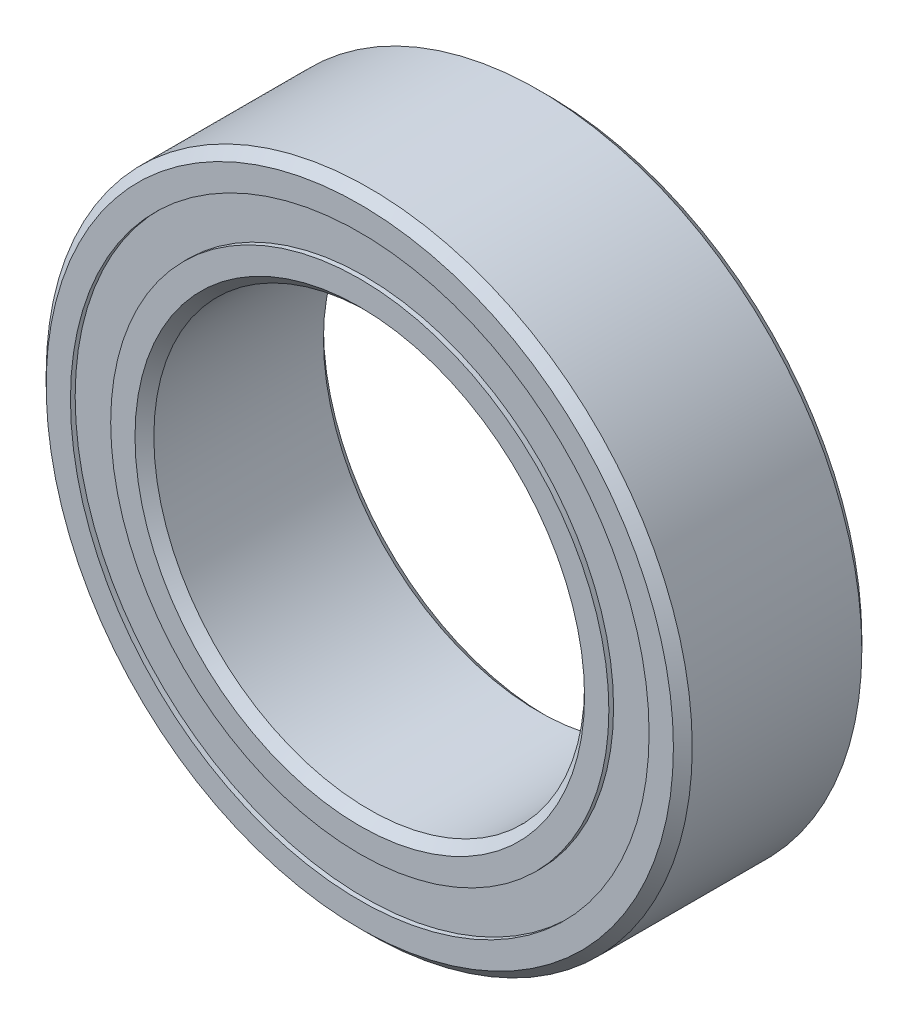
ISO-10303-21;
HEADER;
FILE_DESCRIPTION(('STEP AP214'),'2;1');
FILE_NAME('part.step','',(''),(''),'','','');
FILE_SCHEMA(('AUTOMOTIVE_DESIGN { 1 0 10303 214 1 1 1 1 }'));
ENDSEC;
DATA;
#1=APPLICATION_CONTEXT('core data for automotive mechanical design processes');
#2=APPLICATION_PROTOCOL_DEFINITION('international standard','automotive_design',2000,#1);
#3=PRODUCT_CONTEXT('',#1,'mechanical');
#4=PRODUCT('Part','Part','',(#3));
#5=PRODUCT_RELATED_PRODUCT_CATEGORY('part','',(#4));
#6=PRODUCT_DEFINITION_FORMATION('','',#4);
#7=PRODUCT_DEFINITION_CONTEXT('part definition',#1,'design');
#8=PRODUCT_DEFINITION('design','',#6,#7);
#9=PRODUCT_DEFINITION_SHAPE('','',#8);
#10=(LENGTH_UNIT() NAMED_UNIT(*) SI_UNIT(.MILLI.,.METRE.));
#11=(NAMED_UNIT(*) PLANE_ANGLE_UNIT() SI_UNIT($,.RADIAN.));
#12=(NAMED_UNIT(*) SI_UNIT($,.STERADIAN.) SOLID_ANGLE_UNIT());
#13=UNCERTAINTY_MEASURE_WITH_UNIT(LENGTH_MEASURE(1.E-05),#10,'distance_accuracy_value','');
#14=(GEOMETRIC_REPRESENTATION_CONTEXT(3) GLOBAL_UNCERTAINTY_ASSIGNED_CONTEXT((#13)) GLOBAL_UNIT_ASSIGNED_CONTEXT((#10,
#11,#12)) REPRESENTATION_CONTEXT('',''));
#15=CARTESIAN_POINT('',(0.,0.,0.));
#16=DIRECTION('',(0.,0.,1.));
#17=DIRECTION('',(1.,0.,0.));
#18=AXIS2_PLACEMENT_3D('',#15,#16,#17);
#19=CARTESIAN_POINT('',(0.,5.37362637362637,-1.6625));
#20=DIRECTION('',(0.,0.,1.));
#21=DIRECTION('',(1.,0.,0.));
#22=AXIS2_PLACEMENT_3D('',#19,#20,#21);
#23=PLANE('',#22);
#24=CARTESIAN_POINT('',(0.,0.,-1.6625));
#25=DIRECTION('',(0.,0.,1.));
#26=DIRECTION('',(1.,0.,0.));
#27=AXIS2_PLACEMENT_3D('',#24,#25,#26);
#28=CIRCLE('',#27,5.37362637362637);
#29=CARTESIAN_POINT('',(5.37362637362637,0.,-1.6625));
#30=VERTEX_POINT('',#29);
#31=EDGE_CURVE('E70',#30,#30,#28,.T.);
#32=ORIENTED_EDGE('',*,*,#31,.F.);
#33=EDGE_LOOP('',(#32));
#34=FACE_BOUND('',#33,.T.);
#35=CARTESIAN_POINT('',(0.,0.,-1.6625));
#36=DIRECTION('',(0.,0.,1.));
#37=DIRECTION('',(1.,0.,0.));
#38=AXIS2_PLACEMENT_3D('',#35,#36,#37);
#39=CIRCLE('',#38,4.62637362637363);
#40=CARTESIAN_POINT('',(4.62637362637363,0.,-1.6625));
#41=VERTEX_POINT('',#40);
#42=EDGE_CURVE('E11',#41,#41,#39,.T.);
#43=ORIENTED_EDGE('',*,*,#42,.T.);
#44=EDGE_LOOP('',(#43));
#45=FACE_BOUND('',#44,.T.);
#46=ADVANCED_FACE('F50',(#34,#45),#23,.F.);
#47=CARTESIAN_POINT('',(0.,0.,1.75));
#48=DIRECTION('',(0.,0.,1.));
#49=DIRECTION('',(1.,0.,0.));
#50=AXIS2_PLACEMENT_3D('',#47,#48,#49);
#51=CYLINDRICAL_SURFACE('',#50,4.62637362637363);
#52=ORIENTED_EDGE('',*,*,#42,.F.);
#53=EDGE_LOOP('',(#52));
#54=FACE_BOUND('',#53,.T.);
#55=CARTESIAN_POINT('',(0.,0.,-0.862864380232568));
#56=DIRECTION('',(0.,0.,1.));
#57=DIRECTION('',(1.,0.,0.));
#58=AXIS2_PLACEMENT_3D('',#55,#56,#57);
#59=CIRCLE('',#58,4.62637362637363);
#60=CARTESIAN_POINT('',(4.62637362637363,0.,-0.862864380232568));
#61=VERTEX_POINT('',#60);
#62=EDGE_CURVE('E57',#61,#61,#59,.T.);
#63=ORIENTED_EDGE('',*,*,#62,.T.);
#64=EDGE_LOOP('',(#63));
#65=FACE_BOUND('',#64,.T.);
#66=ADVANCED_FACE('F80',(#54,#65),#51,.F.);
#67=CARTESIAN_POINT('',(0.,5.37362637362637,-0.862864380232568));
#68=DIRECTION('',(0.,0.,-1.));
#69=DIRECTION('',(-1.,0.,0.));
#70=AXIS2_PLACEMENT_3D('',#67,#68,#69);
#71=PLANE('',#70);
#72=ORIENTED_EDGE('',*,*,#62,.F.);
#73=EDGE_LOOP('',(#72));
#74=FACE_BOUND('',#73,.T.);
#75=CARTESIAN_POINT('',(0.,0.,-0.862864380232568));
#76=DIRECTION('',(0.,0.,1.));
#77=DIRECTION('',(1.,0.,0.));
#78=AXIS2_PLACEMENT_3D('',#75,#76,#77);
#79=CIRCLE('',#78,5.37362637362637);
#80=CARTESIAN_POINT('',(5.37362637362637,0.,-0.862864380232568));
#81=VERTEX_POINT('',#80);
#82=EDGE_CURVE('E64',#81,#81,#79,.T.);
#83=ORIENTED_EDGE('',*,*,#82,.T.);
#84=EDGE_LOOP('',(#83));
#85=FACE_BOUND('',#84,.T.);
#86=ADVANCED_FACE('F84',(#74,#85),#71,.F.);
#87=CARTESIAN_POINT('',(0.,0.,1.75));
#88=DIRECTION('',(0.,0.,1.));
#89=DIRECTION('',(1.,0.,0.));
#90=AXIS2_PLACEMENT_3D('',#87,#88,#89);
#91=CYLINDRICAL_SURFACE('',#90,5.37362637362637);
#92=ORIENTED_EDGE('',*,*,#82,.F.);
#93=EDGE_LOOP('',(#92));
#94=FACE_BOUND('',#93,.T.);
#95=ORIENTED_EDGE('',*,*,#31,.T.);
#96=EDGE_LOOP('',(#95));
#97=FACE_BOUND('',#96,.T.);
#98=ADVANCED_FACE('F77',(#94,#97),#91,.T.);
#99=CLOSED_SHELL('',(#46,#66,#86,#98));
#100=MANIFOLD_SOLID_BREP('B2',#99);
#101=CARTESIAN_POINT('',(0.,5.37362637362637,1.6625));
#102=DIRECTION('',(0.,0.,-1.));
#103=DIRECTION('',(-1.,0.,0.));
#104=AXIS2_PLACEMENT_3D('',#101,#102,#103);
#105=PLANE('',#104);
#106=CARTESIAN_POINT('',(0.,0.,1.6625));
#107=DIRECTION('',(0.,0.,1.));
#108=DIRECTION('',(1.,0.,0.));
#109=AXIS2_PLACEMENT_3D('',#106,#107,#108);
#110=CIRCLE('',#109,4.62637362637363);
#111=CARTESIAN_POINT('',(4.62637362637363,0.,1.6625));
#112=VERTEX_POINT('',#111);
#113=EDGE_CURVE('E49',#112,#112,#110,.T.);
#114=ORIENTED_EDGE('',*,*,#113,.F.);
#115=EDGE_LOOP('',(#114));
#116=FACE_BOUND('',#115,.T.);
#117=CARTESIAN_POINT('',(0.,0.,1.6625));
#118=DIRECTION('',(0.,0.,1.));
#119=DIRECTION('',(1.,0.,0.));
#120=AXIS2_PLACEMENT_3D('',#117,#118,#119);
#121=CIRCLE('',#120,5.37362637362637);
#122=CARTESIAN_POINT('',(5.37362637362637,0.,1.6625));
#123=VERTEX_POINT('',#122);
#124=EDGE_CURVE('E146',#123,#123,#121,.T.);
#125=ORIENTED_EDGE('',*,*,#124,.T.);
#126=EDGE_LOOP('',(#125));
#127=FACE_BOUND('',#126,.T.);
#128=ADVANCED_FACE('F126',(#116,#127),#105,.F.);
#129=CARTESIAN_POINT('',(0.,0.,1.75));
#130=DIRECTION('',(0.,0.,1.));
#131=DIRECTION('',(1.,0.,0.));
#132=AXIS2_PLACEMENT_3D('',#129,#130,#131);
#133=CYLINDRICAL_SURFACE('',#132,4.62637362637363);
#134=CARTESIAN_POINT('',(0.,0.,0.862864380232567));
#135=DIRECTION('',(0.,0.,1.));
#136=DIRECTION('',(1.,0.,0.));
#137=AXIS2_PLACEMENT_3D('',#134,#135,#136);
#138=CIRCLE('',#137,4.62637362637363);
#139=CARTESIAN_POINT('',(4.62637362637363,0.,0.862864380232567));
#140=VERTEX_POINT('',#139);
#141=EDGE_CURVE('E133',#140,#140,#138,.T.);
#142=ORIENTED_EDGE('',*,*,#141,.F.);
#143=EDGE_LOOP('',(#142));
#144=FACE_BOUND('',#143,.T.);
#145=ORIENTED_EDGE('',*,*,#113,.T.);
#146=EDGE_LOOP('',(#145));
#147=FACE_BOUND('',#146,.T.);
#148=ADVANCED_FACE('F162',(#144,#147),#133,.F.);
#149=CARTESIAN_POINT('',(0.,5.37362637362637,0.862864380232568));
#150=DIRECTION('',(0.,0.,1.));
#151=DIRECTION('',(1.,0.,0.));
#152=AXIS2_PLACEMENT_3D('',#149,#150,#151);
#153=PLANE('',#152);
#154=CARTESIAN_POINT('',(0.,0.,0.862864380232568));
#155=DIRECTION('',(0.,0.,1.));
#156=DIRECTION('',(1.,0.,0.));
#157=AXIS2_PLACEMENT_3D('',#154,#155,#156);
#158=CIRCLE('',#157,5.37362637362637);
#159=CARTESIAN_POINT('',(5.37362637362637,0.,0.862864380232568));
#160=VERTEX_POINT('',#159);
#161=EDGE_CURVE('E140',#160,#160,#158,.T.);
#162=ORIENTED_EDGE('',*,*,#161,.F.);
#163=EDGE_LOOP('',(#162));
#164=FACE_BOUND('',#163,.T.);
#165=ORIENTED_EDGE('',*,*,#141,.T.);
#166=EDGE_LOOP('',(#165));
#167=FACE_BOUND('',#166,.T.);
#168=ADVANCED_FACE('F157',(#164,#167),#153,.F.);
#169=CARTESIAN_POINT('',(0.,0.,1.75));
#170=DIRECTION('',(0.,0.,1.));
#171=DIRECTION('',(1.,0.,0.));
#172=AXIS2_PLACEMENT_3D('',#169,#170,#171);
#173=CYLINDRICAL_SURFACE('',#172,5.37362637362637);
#174=ORIENTED_EDGE('',*,*,#124,.F.);
#175=EDGE_LOOP('',(#174));
#176=FACE_BOUND('',#175,.T.);
#177=ORIENTED_EDGE('',*,*,#161,.T.);
#178=EDGE_LOOP('',(#177));
#179=FACE_BOUND('',#178,.T.);
#180=ADVANCED_FACE('F154',(#176,#179),#173,.T.);
#181=CLOSED_SHELL('',(#128,#148,#168,#180));
#182=MANIFOLD_SOLID_BREP('B6',#181);
#183=CARTESIAN_POINT('',(-2.49999999999994,4.33012701892223,0.));
#184=DIRECTION('',(0.,0.,1.));
#185=DIRECTION('',(-0.499999999999989,0.866025403784445,0.));
#186=AXIS2_PLACEMENT_3D('',#183,#184,#185);
#187=SPHERICAL_SURFACE('',#186,0.862864380232568);
#188=CARTESIAN_POINT('',(-2.49999999999994,4.33012701892223,0.862864380232568));
#189=VERTEX_POINT('',#188);
#190=VERTEX_LOOP('',#189);
#191=FACE_BOUND('',#190,.T.);
#192=ADVANCED_FACE('F202',(#191),#187,.T.);
#193=CLOSED_SHELL('',(#192));
#194=MANIFOLD_SOLID_BREP('B44',#193);
#195=CARTESIAN_POINT('',(-4.33012701892216,2.50000000000005,0.));
#196=DIRECTION('',(0.,0.,1.));
#197=DIRECTION('',(-0.866025403784433,0.50000000000001,0.));
#198=AXIS2_PLACEMENT_3D('',#195,#196,#197);
#199=SPHERICAL_SURFACE('',#198,0.862864380232568);
#200=CARTESIAN_POINT('',(-4.33012701892216,2.50000000000005,0.862864380232568));
#201=VERTEX_POINT('',#200);
#202=VERTEX_LOOP('',#201);
#203=FACE_BOUND('',#202,.T.);
#204=ADVANCED_FACE('F223',(#203),#199,.T.);
#205=CLOSED_SHELL('',(#204));
#206=MANIFOLD_SOLID_BREP('B122',#205);
#207=CARTESIAN_POINT('',(-5.,0.,0.));
#208=DIRECTION('',(0.,0.,1.));
#209=DIRECTION('',(-1.,0.,0.));
#210=AXIS2_PLACEMENT_3D('',#207,#208,#209);
#211=SPHERICAL_SURFACE('',#210,0.862864380232568);
#212=CARTESIAN_POINT('',(-5.,0.,0.862864380232568));
#213=VERTEX_POINT('',#212);
#214=VERTEX_LOOP('',#213);
#215=FACE_BOUND('',#214,.T.);
#216=ADVANCED_FACE('F244',(#215),#211,.T.);
#217=CLOSED_SHELL('',(#216));
#218=MANIFOLD_SOLID_BREP('B198',#217);
#219=CARTESIAN_POINT('',(-4.33012701892222,-2.49999999999996,0.));
#220=DIRECTION('',(0.,0.,1.));
#221=DIRECTION('',(-0.866025403784443,-0.499999999999992,0.));
#222=AXIS2_PLACEMENT_3D('',#219,#220,#221);
#223=SPHERICAL_SURFACE('',#222,0.862864380232568);
#224=CARTESIAN_POINT('',(-4.33012701892222,-2.49999999999996,0.862864380232568));
#225=VERTEX_POINT('',#224);
#226=VERTEX_LOOP('',#225);
#227=FACE_BOUND('',#226,.T.);
#228=ADVANCED_FACE('F265',(#227),#223,.T.);
#229=CLOSED_SHELL('',(#228));
#230=MANIFOLD_SOLID_BREP('B219',#229);
#231=CARTESIAN_POINT('',(-2.50000000000004,-4.33012701892217,0.));
#232=DIRECTION('',(0.,0.,1.));
#233=DIRECTION('',(-0.500000000000007,-0.866025403784435,0.));
#234=AXIS2_PLACEMENT_3D('',#231,#232,#233);
#235=SPHERICAL_SURFACE('',#234,0.862864380232568);
#236=CARTESIAN_POINT('',(-2.50000000000004,-4.33012701892217,0.862864380232568));
#237=VERTEX_POINT('',#236);
#238=VERTEX_LOOP('',#237);
#239=FACE_BOUND('',#238,.T.);
#240=ADVANCED_FACE('F286',(#239),#235,.T.);
#241=CLOSED_SHELL('',(#240));
#242=MANIFOLD_SOLID_BREP('B240',#241);
#243=CARTESIAN_POINT('',(0.,-5.,0.));
#244=DIRECTION('',(0.,0.,1.));
#245=DIRECTION('',(0.,-1.,0.));
#246=AXIS2_PLACEMENT_3D('',#243,#244,#245);
#247=SPHERICAL_SURFACE('',#246,0.862864380232568);
#248=CARTESIAN_POINT('',(0.,-5.,0.862864380232568));
#249=VERTEX_POINT('',#248);
#250=VERTEX_LOOP('',#249);
#251=FACE_BOUND('',#250,.T.);
#252=ADVANCED_FACE('F307',(#251),#247,.T.);
#253=CLOSED_SHELL('',(#252));
#254=MANIFOLD_SOLID_BREP('B261',#253);
#255=CARTESIAN_POINT('',(2.49999999999997,-4.33012701892221,0.));
#256=DIRECTION('',(0.,0.,1.));
#257=DIRECTION('',(0.499999999999995,-0.866025403784442,0.));
#258=AXIS2_PLACEMENT_3D('',#255,#256,#257);
#259=SPHERICAL_SURFACE('',#258,0.862864380232568);
#260=CARTESIAN_POINT('',(2.49999999999997,-4.33012701892221,0.862864380232568));
#261=VERTEX_POINT('',#260);
#262=VERTEX_LOOP('',#261);
#263=FACE_BOUND('',#262,.T.);
#264=ADVANCED_FACE('F328',(#263),#259,.T.);
#265=CLOSED_SHELL('',(#264));
#266=MANIFOLD_SOLID_BREP('B282',#265);
#267=CARTESIAN_POINT('',(4.33012701892218,-2.50000000000002,0.));
#268=DIRECTION('',(0.,0.,1.));
#269=DIRECTION('',(0.866025403784436,-0.500000000000004,0.));
#270=AXIS2_PLACEMENT_3D('',#267,#268,#269);
#271=SPHERICAL_SURFACE('',#270,0.862864380232568);
#272=CARTESIAN_POINT('',(4.33012701892218,-2.50000000000002,0.862864380232568));
#273=VERTEX_POINT('',#272);
#274=VERTEX_LOOP('',#273);
#275=FACE_BOUND('',#274,.T.);
#276=ADVANCED_FACE('F349',(#275),#271,.T.);
#277=CLOSED_SHELL('',(#276));
#278=MANIFOLD_SOLID_BREP('B303',#277);
#279=CARTESIAN_POINT('',(5.,0.,0.));
#280=DIRECTION('',(0.,0.,1.));
#281=DIRECTION('',(1.,0.,0.));
#282=AXIS2_PLACEMENT_3D('',#279,#280,#281);
#283=SPHERICAL_SURFACE('',#282,0.862864380232568);
#284=CARTESIAN_POINT('',(5.,0.,0.862864380232568));
#285=VERTEX_POINT('',#284);
#286=VERTEX_LOOP('',#285);
#287=FACE_BOUND('',#286,.T.);
#288=ADVANCED_FACE('F370',(#287),#283,.T.);
#289=CLOSED_SHELL('',(#288));
#290=MANIFOLD_SOLID_BREP('B324',#289);
#291=CARTESIAN_POINT('',(4.3301270189222,2.49999999999999,0.));
#292=DIRECTION('',(0.,0.,1.));
#293=DIRECTION('',(0.86602540378444,0.499999999999998,0.));
#294=AXIS2_PLACEMENT_3D('',#291,#292,#293);
#295=SPHERICAL_SURFACE('',#294,0.862864380232568);
#296=CARTESIAN_POINT('',(4.3301270189222,2.49999999999999,0.862864380232568));
#297=VERTEX_POINT('',#296);
#298=VERTEX_LOOP('',#297);
#299=FACE_BOUND('',#298,.T.);
#300=ADVANCED_FACE('F391',(#299),#295,.T.);
#301=CLOSED_SHELL('',(#300));
#302=MANIFOLD_SOLID_BREP('B345',#301);
#303=CARTESIAN_POINT('',(2.50000000000001,4.33012701892219,0.));
#304=DIRECTION('',(0.,0.,1.));
#305=DIRECTION('',(0.500000000000001,0.866025403784438,0.));
#306=AXIS2_PLACEMENT_3D('',#303,#304,#305);
#307=SPHERICAL_SURFACE('',#306,0.862864380232568);
#308=CARTESIAN_POINT('',(2.50000000000001,4.33012701892219,0.862864380232568));
#309=VERTEX_POINT('',#308);
#310=VERTEX_LOOP('',#309);
#311=FACE_BOUND('',#310,.T.);
#312=ADVANCED_FACE('F412',(#311),#307,.T.);
#313=CLOSED_SHELL('',(#312));
#314=MANIFOLD_SOLID_BREP('B366',#313);
#315=CARTESIAN_POINT('',(0.,5.,0.));
#316=DIRECTION('',(0.,0.,1.));
#317=DIRECTION('',(0.,1.,0.));
#318=AXIS2_PLACEMENT_3D('',#315,#316,#317);
#319=SPHERICAL_SURFACE('',#318,0.862864380232568);
#320=CARTESIAN_POINT('',(0.,5.,0.862864380232568));
#321=VERTEX_POINT('',#320);
#322=VERTEX_LOOP('',#321);
#323=FACE_BOUND('',#322,.T.);
#324=ADVANCED_FACE('F435',(#323),#319,.T.);
#325=CLOSED_SHELL('',(#324));
#326=MANIFOLD_SOLID_BREP('B387',#325);
#327=CARTESIAN_POINT('',(0.,4.62637362637363,1.75));
#328=DIRECTION('',(0.,0.,-1.));
#329=DIRECTION('',(-1.,0.,0.));
#330=AXIS2_PLACEMENT_3D('',#327,#328,#329);
#331=PLANE('',#330);
#332=CARTESIAN_POINT('',(0.,0.,1.75));
#333=DIRECTION('',(0.,0.,1.));
#334=DIRECTION('',(1.,0.,0.));
#335=AXIS2_PLACEMENT_3D('',#332,#333,#334);
#336=CIRCLE('',#335,4.175);
#337=CARTESIAN_POINT('',(4.175,0.,1.75));
#338=VERTEX_POINT('',#337);
#339=EDGE_CURVE('E493',#338,#338,#336,.T.);
#340=ORIENTED_EDGE('',*,*,#339,.F.);
#341=EDGE_LOOP('',(#340));
#342=FACE_BOUND('',#341,.T.);
#343=CARTESIAN_POINT('',(0.,0.,1.75));
#344=DIRECTION('',(0.,0.,1.));
#345=DIRECTION('',(1.,0.,0.));
#346=AXIS2_PLACEMENT_3D('',#343,#344,#345);
#347=CIRCLE('',#346,4.62637362637363);
#348=CARTESIAN_POINT('',(4.62637362637363,0.,1.75));
#349=VERTEX_POINT('',#348);
#350=EDGE_CURVE('E434',#349,#349,#347,.T.);
#351=ORIENTED_EDGE('',*,*,#350,.T.);
#352=EDGE_LOOP('',(#351));
#353=FACE_BOUND('',#352,.T.);
#354=ADVANCED_FACE('F455',(#342,#353),#331,.F.);
#355=CARTESIAN_POINT('',(0.,0.,1.75));
#356=DIRECTION('',(0.,0.,1.));
#357=DIRECTION('',(1.,0.,0.));
#358=AXIS2_PLACEMENT_3D('',#355,#356,#357);
#359=CYLINDRICAL_SURFACE('',#358,4.62637362637363);
#360=ORIENTED_EDGE('',*,*,#350,.F.);
#361=EDGE_LOOP('',(#360));
#362=FACE_BOUND('',#361,.T.);
#363=CARTESIAN_POINT('',(0.,0.,0.777777777777778));
#364=DIRECTION('',(0.,0.,1.));
#365=DIRECTION('',(1.,0.,0.));
#366=AXIS2_PLACEMENT_3D('',#363,#364,#365);
#367=CIRCLE('',#366,4.62637362637363);
#368=CARTESIAN_POINT('',(4.62637362637363,0.,0.777777777777778));
#369=VERTEX_POINT('',#368);
#370=EDGE_CURVE('E462',#369,#369,#367,.T.);
#371=ORIENTED_EDGE('',*,*,#370,.T.);
#372=EDGE_LOOP('',(#371));
#373=FACE_BOUND('',#372,.T.);
#374=ADVANCED_FACE('F501',(#362,#373),#359,.T.);
#375=CARTESIAN_POINT('',(0.,0.,0.));
#376=DIRECTION('',(0.,0.,1.));
#377=DIRECTION('',(1.,0.,0.));
#378=AXIS2_PLACEMENT_3D('',#375,#376,#377);
#379=TOROIDAL_SURFACE('',#378,5.,0.862864380232566);
#380=ORIENTED_EDGE('',*,*,#370,.F.);
#381=EDGE_LOOP('',(#380));
#382=FACE_BOUND('',#381,.T.);
#383=CARTESIAN_POINT('',(0.,0.,-0.777777777777779));
#384=DIRECTION('',(0.,0.,1.));
#385=DIRECTION('',(1.,0.,0.));
#386=AXIS2_PLACEMENT_3D('',#383,#384,#385);
#387=CIRCLE('',#386,4.62637362637363);
#388=CARTESIAN_POINT('',(4.62637362637363,0.,-0.777777777777779));
#389=VERTEX_POINT('',#388);
#390=EDGE_CURVE('E469',#389,#389,#387,.T.);
#391=ORIENTED_EDGE('',*,*,#390,.T.);
#392=EDGE_LOOP('',(#391));
#393=FACE_BOUND('',#392,.T.);
#394=ADVANCED_FACE('F505',(#382,#393),#379,.F.);
#395=CARTESIAN_POINT('',(0.,0.,1.75));
#396=DIRECTION('',(0.,0.,1.));
#397=DIRECTION('',(1.,0.,0.));
#398=AXIS2_PLACEMENT_3D('',#395,#396,#397);
#399=CYLINDRICAL_SURFACE('',#398,4.62637362637363);
#400=ORIENTED_EDGE('',*,*,#390,.F.);
#401=EDGE_LOOP('',(#400));
#402=FACE_BOUND('',#401,.T.);
#403=CARTESIAN_POINT('',(0.,0.,-1.75));
#404=DIRECTION('',(0.,0.,1.));
#405=DIRECTION('',(1.,0.,0.));
#406=AXIS2_PLACEMENT_3D('',#403,#404,#405);
#407=CIRCLE('',#406,4.62637362637363);
#408=CARTESIAN_POINT('',(4.62637362637363,0.,-1.75));
#409=VERTEX_POINT('',#408);
#410=EDGE_CURVE('E475',#409,#409,#407,.T.);
#411=ORIENTED_EDGE('',*,*,#410,.T.);
#412=EDGE_LOOP('',(#411));
#413=FACE_BOUND('',#412,.T.);
#414=ADVANCED_FACE('F510',(#402,#413),#399,.T.);
#415=CARTESIAN_POINT('',(0.,4.175,-1.75));
#416=DIRECTION('',(0.,0.,1.));
#417=DIRECTION('',(1.,0.,0.));
#418=AXIS2_PLACEMENT_3D('',#415,#416,#417);
#419=PLANE('',#418);
#420=ORIENTED_EDGE('',*,*,#410,.F.);
#421=EDGE_LOOP('',(#420));
#422=FACE_BOUND('',#421,.T.);
#423=CARTESIAN_POINT('',(0.,0.,-1.75));
#424=DIRECTION('',(0.,0.,1.));
#425=DIRECTION('',(1.,0.,0.));
#426=AXIS2_PLACEMENT_3D('',#423,#424,#425);
#427=CIRCLE('',#426,4.175);
#428=CARTESIAN_POINT('',(4.175,0.,-1.75));
#429=VERTEX_POINT('',#428);
#430=EDGE_CURVE('E481',#429,#429,#427,.T.);
#431=ORIENTED_EDGE('',*,*,#430,.T.);
#432=EDGE_LOOP('',(#431));
#433=FACE_BOUND('',#432,.T.);
#434=ADVANCED_FACE('F516',(#422,#433),#419,.F.);
#435=CARTESIAN_POINT('',(0.,0.,-1.575));
#436=DIRECTION('',(0.,0.,-1.));
#437=DIRECTION('',(-1.,0.,0.));
#438=AXIS2_PLACEMENT_3D('',#435,#436,#437);
#439=CONICAL_SURFACE('',#438,4.,0.785398163397447);
#440=ORIENTED_EDGE('',*,*,#430,.F.);
#441=EDGE_LOOP('',(#440));
#442=FACE_BOUND('',#441,.T.);
#443=CARTESIAN_POINT('',(0.,0.,-1.575));
#444=DIRECTION('',(0.,0.,1.));
#445=DIRECTION('',(1.,0.,0.));
#446=AXIS2_PLACEMENT_3D('',#443,#444,#445);
#447=CIRCLE('',#446,4.);
#448=CARTESIAN_POINT('',(4.,0.,-1.575));
#449=VERTEX_POINT('',#448);
#450=EDGE_CURVE('E485',#449,#449,#447,.T.);
#451=ORIENTED_EDGE('',*,*,#450,.T.);
#452=EDGE_LOOP('',(#451));
#453=FACE_BOUND('',#452,.T.);
#454=ADVANCED_FACE('F520',(#442,#453),#439,.F.);
#455=CARTESIAN_POINT('',(0.,0.,1.75));
#456=DIRECTION('',(0.,0.,1.));
#457=DIRECTION('',(1.,0.,0.));
#458=AXIS2_PLACEMENT_3D('',#455,#456,#457);
#459=CYLINDRICAL_SURFACE('',#458,4.);
#460=ORIENTED_EDGE('',*,*,#450,.F.);
#461=EDGE_LOOP('',(#460));
#462=FACE_BOUND('',#461,.T.);
#463=CARTESIAN_POINT('',(0.,0.,1.575));
#464=DIRECTION('',(0.,0.,1.));
#465=DIRECTION('',(1.,0.,0.));
#466=AXIS2_PLACEMENT_3D('',#463,#464,#465);
#467=CIRCLE('',#466,4.);
#468=CARTESIAN_POINT('',(4.,0.,1.575));
#469=VERTEX_POINT('',#468);
#470=EDGE_CURVE('E489',#469,#469,#467,.T.);
#471=ORIENTED_EDGE('',*,*,#470,.T.);
#472=EDGE_LOOP('',(#471));
#473=FACE_BOUND('',#472,.T.);
#474=ADVANCED_FACE('F524',(#462,#473),#459,.F.);
#475=CARTESIAN_POINT('',(0.,0.,1.75));
#476=DIRECTION('',(0.,0.,1.));
#477=DIRECTION('',(1.,0.,0.));
#478=AXIS2_PLACEMENT_3D('',#475,#476,#477);
#479=CONICAL_SURFACE('',#478,4.175,0.785398163397448);
#480=ORIENTED_EDGE('',*,*,#470,.F.);
#481=EDGE_LOOP('',(#480));
#482=FACE_BOUND('',#481,.T.);
#483=ORIENTED_EDGE('',*,*,#339,.T.);
#484=EDGE_LOOP('',(#483));
#485=FACE_BOUND('',#484,.T.);
#486=ADVANCED_FACE('F498',(#482,#485),#479,.F.);
#487=CLOSED_SHELL('',(#354,#374,#394,#414,#434,#454,#474,#486));
#488=MANIFOLD_SOLID_BREP('B408',#487);
#489=CARTESIAN_POINT('',(0.,0.,1.575));
#490=DIRECTION('',(0.,0.,-1.));
#491=DIRECTION('',(-1.,0.,0.));
#492=AXIS2_PLACEMENT_3D('',#489,#490,#491);
#493=CONICAL_SURFACE('',#492,6.,0.785398163397448);
#494=CARTESIAN_POINT('',(0.,0.,1.75));
#495=DIRECTION('',(0.,0.,1.));
#496=DIRECTION('',(1.,0.,0.));
#497=AXIS2_PLACEMENT_3D('',#494,#495,#496);
#498=CIRCLE('',#497,5.825);
#499=CARTESIAN_POINT('',(5.825,0.,1.75));
#500=VERTEX_POINT('',#499);
#501=EDGE_CURVE('E631',#500,#500,#498,.T.);
#502=ORIENTED_EDGE('',*,*,#501,.F.);
#503=EDGE_LOOP('',(#502));
#504=FACE_BOUND('',#503,.T.);
#505=CARTESIAN_POINT('',(0.,0.,1.575));
#506=DIRECTION('',(0.,0.,1.));
#507=DIRECTION('',(1.,0.,0.));
#508=AXIS2_PLACEMENT_3D('',#505,#506,#507);
#509=CIRCLE('',#508,6.);
#510=CARTESIAN_POINT('',(6.,0.,1.575));
#511=VERTEX_POINT('',#510);
#512=EDGE_CURVE('E454',#511,#511,#509,.T.);
#513=ORIENTED_EDGE('',*,*,#512,.T.);
#514=EDGE_LOOP('',(#513));
#515=FACE_BOUND('',#514,.T.);
#516=ADVANCED_FACE('F593',(#504,#515),#493,.T.);
#517=CARTESIAN_POINT('',(0.,0.,1.75));
#518=DIRECTION('',(0.,0.,1.));
#519=DIRECTION('',(1.,0.,0.));
#520=AXIS2_PLACEMENT_3D('',#517,#518,#519);
#521=CYLINDRICAL_SURFACE('',#520,6.);
#522=ORIENTED_EDGE('',*,*,#512,.F.);
#523=EDGE_LOOP('',(#522));
#524=FACE_BOUND('',#523,.T.);
#525=CARTESIAN_POINT('',(0.,0.,-1.575));
#526=DIRECTION('',(0.,0.,1.));
#527=DIRECTION('',(1.,0.,0.));
#528=AXIS2_PLACEMENT_3D('',#525,#526,#527);
#529=CIRCLE('',#528,6.);
#530=CARTESIAN_POINT('',(6.,0.,-1.575));
#531=VERTEX_POINT('',#530);
#532=EDGE_CURVE('E600',#531,#531,#529,.T.);
#533=ORIENTED_EDGE('',*,*,#532,.T.);
#534=EDGE_LOOP('',(#533));
#535=FACE_BOUND('',#534,.T.);
#536=ADVANCED_FACE('F639',(#524,#535),#521,.T.);
#537=CARTESIAN_POINT('',(0.,0.,-1.75));
#538=DIRECTION('',(0.,0.,1.));
#539=DIRECTION('',(1.,0.,0.));
#540=AXIS2_PLACEMENT_3D('',#537,#538,#539);
#541=CONICAL_SURFACE('',#540,5.825,0.785398163397447);
#542=ORIENTED_EDGE('',*,*,#532,.F.);
#543=EDGE_LOOP('',(#542));
#544=FACE_BOUND('',#543,.T.);
#545=CARTESIAN_POINT('',(0.,0.,-1.75));
#546=DIRECTION('',(0.,0.,1.));
#547=DIRECTION('',(1.,0.,0.));
#548=AXIS2_PLACEMENT_3D('',#545,#546,#547);
#549=CIRCLE('',#548,5.825);
#550=CARTESIAN_POINT('',(5.825,0.,-1.75));
#551=VERTEX_POINT('',#550);
#552=EDGE_CURVE('E607',#551,#551,#549,.T.);
#553=ORIENTED_EDGE('',*,*,#552,.T.);
#554=EDGE_LOOP('',(#553));
#555=FACE_BOUND('',#554,.T.);
#556=ADVANCED_FACE('F643',(#544,#555),#541,.T.);
#557=CARTESIAN_POINT('',(0.,5.825,-1.75));
#558=DIRECTION('',(0.,0.,1.));
#559=DIRECTION('',(1.,0.,0.));
#560=AXIS2_PLACEMENT_3D('',#557,#558,#559);
#561=PLANE('',#560);
#562=ORIENTED_EDGE('',*,*,#552,.F.);
#563=EDGE_LOOP('',(#562));
#564=FACE_BOUND('',#563,.T.);
#565=CARTESIAN_POINT('',(0.,0.,-1.75));
#566=DIRECTION('',(0.,0.,1.));
#567=DIRECTION('',(1.,0.,0.));
#568=AXIS2_PLACEMENT_3D('',#565,#566,#567);
#569=CIRCLE('',#568,5.37362637362637);
#570=CARTESIAN_POINT('',(5.37362637362637,0.,-1.75));
#571=VERTEX_POINT('',#570);
#572=EDGE_CURVE('E613',#571,#571,#569,.T.);
#573=ORIENTED_EDGE('',*,*,#572,.T.);
#574=EDGE_LOOP('',(#573));
#575=FACE_BOUND('',#574,.T.);
#576=ADVANCED_FACE('F648',(#564,#575),#561,.F.);
#577=CARTESIAN_POINT('',(0.,0.,1.75));
#578=DIRECTION('',(0.,0.,1.));
#579=DIRECTION('',(1.,0.,0.));
#580=AXIS2_PLACEMENT_3D('',#577,#578,#579);
#581=CYLINDRICAL_SURFACE('',#580,5.37362637362637);
#582=ORIENTED_EDGE('',*,*,#572,.F.);
#583=EDGE_LOOP('',(#582));
#584=FACE_BOUND('',#583,.T.);
#585=CARTESIAN_POINT('',(0.,0.,-0.777777777777778));
#586=DIRECTION('',(0.,0.,1.));
#587=DIRECTION('',(1.,0.,0.));
#588=AXIS2_PLACEMENT_3D('',#585,#586,#587);
#589=CIRCLE('',#588,5.37362637362637);
#590=CARTESIAN_POINT('',(5.37362637362637,0.,-0.777777777777778));
#591=VERTEX_POINT('',#590);
#592=EDGE_CURVE('E619',#591,#591,#589,.T.);
#593=ORIENTED_EDGE('',*,*,#592,.T.);
#594=EDGE_LOOP('',(#593));
#595=FACE_BOUND('',#594,.T.);
#596=ADVANCED_FACE('F654',(#584,#595),#581,.F.);
#597=CARTESIAN_POINT('',(0.,0.,0.));
#598=DIRECTION('',(0.,0.,1.));
#599=DIRECTION('',(1.,0.,0.));
#600=AXIS2_PLACEMENT_3D('',#597,#598,#599);
#601=TOROIDAL_SURFACE('',#600,5.,0.862864380232568);
#602=ORIENTED_EDGE('',*,*,#592,.F.);
#603=EDGE_LOOP('',(#602));
#604=FACE_BOUND('',#603,.T.);
#605=CARTESIAN_POINT('',(0.,0.,0.777777777777778));
#606=DIRECTION('',(0.,0.,1.));
#607=DIRECTION('',(1.,0.,0.));
#608=AXIS2_PLACEMENT_3D('',#605,#606,#607);
#609=CIRCLE('',#608,5.37362637362637);
#610=CARTESIAN_POINT('',(5.37362637362637,0.,0.777777777777778));
#611=VERTEX_POINT('',#610);
#612=EDGE_CURVE('E623',#611,#611,#609,.T.);
#613=ORIENTED_EDGE('',*,*,#612,.T.);
#614=EDGE_LOOP('',(#613));
#615=FACE_BOUND('',#614,.T.);
#616=ADVANCED_FACE('F658',(#604,#615),#601,.F.);
#617=CARTESIAN_POINT('',(0.,0.,1.75));
#618=DIRECTION('',(0.,0.,1.));
#619=DIRECTION('',(1.,0.,0.));
#620=AXIS2_PLACEMENT_3D('',#617,#618,#619);
#621=CYLINDRICAL_SURFACE('',#620,5.37362637362637);
#622=ORIENTED_EDGE('',*,*,#612,.F.);
#623=EDGE_LOOP('',(#622));
#624=FACE_BOUND('',#623,.T.);
#625=CARTESIAN_POINT('',(0.,0.,1.75));
#626=DIRECTION('',(0.,0.,1.));
#627=DIRECTION('',(1.,0.,0.));
#628=AXIS2_PLACEMENT_3D('',#625,#626,#627);
#629=CIRCLE('',#628,5.37362637362637);
#630=CARTESIAN_POINT('',(5.37362637362637,0.,1.75));
#631=VERTEX_POINT('',#630);
#632=EDGE_CURVE('E627',#631,#631,#629,.T.);
#633=ORIENTED_EDGE('',*,*,#632,.T.);
#634=EDGE_LOOP('',(#633));
#635=FACE_BOUND('',#634,.T.);
#636=ADVANCED_FACE('F662',(#624,#635),#621,.F.);
#637=CARTESIAN_POINT('',(0.,5.825,1.75));
#638=DIRECTION('',(0.,0.,-1.));
#639=DIRECTION('',(-1.,0.,0.));
#640=AXIS2_PLACEMENT_3D('',#637,#638,#639);
#641=PLANE('',#640);
#642=ORIENTED_EDGE('',*,*,#632,.F.);
#643=EDGE_LOOP('',(#642));
#644=FACE_BOUND('',#643,.T.);
#645=ORIENTED_EDGE('',*,*,#501,.T.);
#646=EDGE_LOOP('',(#645));
#647=FACE_BOUND('',#646,.T.);
#648=ADVANCED_FACE('F636',(#644,#647),#641,.F.);
#649=CLOSED_SHELL('',(#516,#536,#556,#576,#596,#616,#636,#648));
#650=MANIFOLD_SOLID_BREP('B429',#649);
#651=ADVANCED_BREP_SHAPE_REPRESENTATION('',(#18,#100,#182,#194,#206,#218,#230,#242,#254,#266,
#278,#290,#302,#314,#326,#488,#650),#14);
#652=SHAPE_DEFINITION_REPRESENTATION(#9,#651);
ENDSEC;
END-ISO-10303-21;
